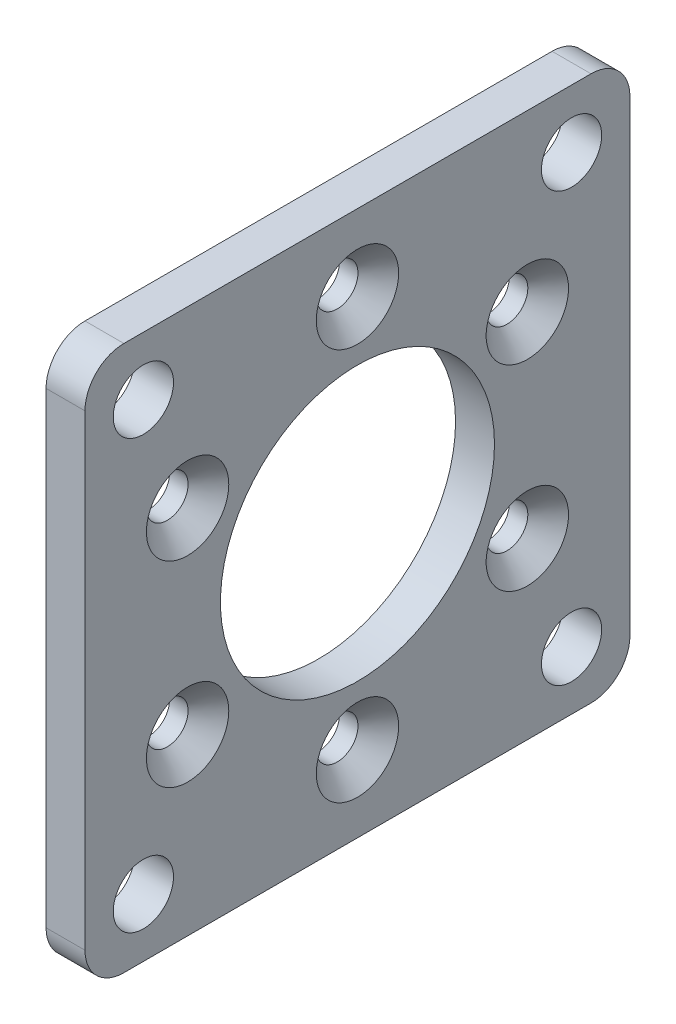
ISO-10303-21;
HEADER;
FILE_DESCRIPTION(('STEP AP214'),'2;1');
FILE_NAME('part.step','',(''),(''),'','','');
FILE_SCHEMA(('AUTOMOTIVE_DESIGN { 1 0 10303 214 1 1 1 1 }'));
ENDSEC;
DATA;
#1=APPLICATION_CONTEXT('core data for automotive mechanical design processes');
#2=APPLICATION_PROTOCOL_DEFINITION('international standard','automotive_design',2000,#1);
#3=PRODUCT_CONTEXT('',#1,'mechanical');
#4=PRODUCT('Part','Part','',(#3));
#5=PRODUCT_RELATED_PRODUCT_CATEGORY('part','',(#4));
#6=PRODUCT_DEFINITION_FORMATION('','',#4);
#7=PRODUCT_DEFINITION_CONTEXT('part definition',#1,'design');
#8=PRODUCT_DEFINITION('design','',#6,#7);
#9=PRODUCT_DEFINITION_SHAPE('','',#8);
#10=(LENGTH_UNIT() NAMED_UNIT(*) SI_UNIT(.MILLI.,.METRE.));
#11=(NAMED_UNIT(*) PLANE_ANGLE_UNIT() SI_UNIT($,.RADIAN.));
#12=(NAMED_UNIT(*) SI_UNIT($,.STERADIAN.) SOLID_ANGLE_UNIT());
#13=UNCERTAINTY_MEASURE_WITH_UNIT(LENGTH_MEASURE(1.E-05),#10,'distance_accuracy_value','');
#14=(GEOMETRIC_REPRESENTATION_CONTEXT(3) GLOBAL_UNCERTAINTY_ASSIGNED_CONTEXT((#13)) GLOBAL_UNIT_ASSIGNED_CONTEXT((#10,
#11,#12)) REPRESENTATION_CONTEXT('',''));
#15=CARTESIAN_POINT('',(0.,0.,0.));
#16=DIRECTION('',(0.,0.,1.));
#17=DIRECTION('',(1.,0.,0.));
#18=AXIS2_PLACEMENT_3D('',#15,#16,#17);
#19=CARTESIAN_POINT('',(3.175,0.,0.));
#20=DIRECTION('',(1.,0.,0.));
#21=DIRECTION('',(0.,0.,-1.));
#22=AXIS2_PLACEMENT_3D('',#19,#20,#21);
#23=PLANE('',#22);
#24=CARTESIAN_POINT('',(3.175,16.,0.));
#25=DIRECTION('',(1.,0.,0.));
#26=DIRECTION('',(0.,0.,-1.));
#27=AXIS2_PLACEMENT_3D('',#24,#25,#26);
#28=CIRCLE('',#27,3.36);
#29=CARTESIAN_POINT('',(3.175,16.,-3.36));
#30=VERTEX_POINT('',#29);
#31=EDGE_CURVE('E265',#30,#30,#28,.T.);
#32=ORIENTED_EDGE('',*,*,#31,.F.);
#33=EDGE_LOOP('',(#32));
#34=FACE_BOUND('',#33,.T.);
#35=CARTESIAN_POINT('',(3.175,8.00000000000145,-13.8564064605519));
#36=DIRECTION('',(1.,0.,0.));
#37=DIRECTION('',(0.,0.,-1.));
#38=AXIS2_PLACEMENT_3D('',#35,#36,#37);
#39=CIRCLE('',#38,3.36);
#40=CARTESIAN_POINT('',(3.175,8.00000000000145,-17.2164064605519));
#41=VERTEX_POINT('',#40);
#42=EDGE_CURVE('E256',#41,#41,#39,.T.);
#43=ORIENTED_EDGE('',*,*,#42,.F.);
#44=EDGE_LOOP('',(#43));
#45=FACE_BOUND('',#44,.T.);
#46=CARTESIAN_POINT('',(3.175,-7.99999999999855,-13.8564064605535));
#47=DIRECTION('',(1.,0.,0.));
#48=DIRECTION('',(0.,0.,-1.));
#49=AXIS2_PLACEMENT_3D('',#46,#47,#48);
#50=CIRCLE('',#49,3.36);
#51=CARTESIAN_POINT('',(3.175,-7.99999999999855,-17.2164064605535));
#52=VERTEX_POINT('',#51);
#53=EDGE_CURVE('E247',#52,#52,#50,.T.);
#54=ORIENTED_EDGE('',*,*,#53,.F.);
#55=EDGE_LOOP('',(#54));
#56=FACE_BOUND('',#55,.T.);
#57=CARTESIAN_POINT('',(3.175,-16.,-3.34338137020771E-12));
#58=DIRECTION('',(1.,0.,0.));
#59=DIRECTION('',(0.,0.,-1.));
#60=AXIS2_PLACEMENT_3D('',#57,#58,#59);
#61=CIRCLE('',#60,3.36);
#62=CARTESIAN_POINT('',(3.175,-16.,-3.36000000000334));
#63=VERTEX_POINT('',#62);
#64=EDGE_CURVE('E238',#63,#63,#61,.T.);
#65=ORIENTED_EDGE('',*,*,#64,.F.);
#66=EDGE_LOOP('',(#65));
#67=FACE_BOUND('',#66,.T.);
#68=CARTESIAN_POINT('',(3.175,-8.00000000000145,13.8564064605485));
#69=DIRECTION('',(1.,0.,0.));
#70=DIRECTION('',(0.,0.,-1.));
#71=AXIS2_PLACEMENT_3D('',#68,#69,#70);
#72=CIRCLE('',#71,3.36);
#73=CARTESIAN_POINT('',(3.175,-8.00000000000145,10.4964064605485));
#74=VERTEX_POINT('',#73);
#75=EDGE_CURVE('E229',#74,#74,#72,.T.);
#76=ORIENTED_EDGE('',*,*,#75,.F.);
#77=EDGE_LOOP('',(#76));
#78=FACE_BOUND('',#77,.T.);
#79=CARTESIAN_POINT('',(3.175,7.99999999999856,13.8564064605502));
#80=DIRECTION('',(1.,0.,0.));
#81=DIRECTION('',(0.,0.,-1.));
#82=AXIS2_PLACEMENT_3D('',#79,#80,#81);
#83=CIRCLE('',#82,3.36);
#84=CARTESIAN_POINT('',(3.175,7.99999999999856,10.4964064605502));
#85=VERTEX_POINT('',#84);
#86=EDGE_CURVE('E220',#85,#85,#83,.T.);
#87=ORIENTED_EDGE('',*,*,#86,.F.);
#88=EDGE_LOOP('',(#87));
#89=FACE_BOUND('',#88,.T.);
#90=CARTESIAN_POINT('',(3.175,17.4625,17.4625));
#91=DIRECTION('',(1.,0.,0.));
#92=DIRECTION('',(0.,0.,-1.));
#93=AXIS2_PLACEMENT_3D('',#90,#91,#92);
#94=CIRCLE('',#93,2.45745);
#95=CARTESIAN_POINT('',(3.175,17.4625,15.00505));
#96=VERTEX_POINT('',#95);
#97=EDGE_CURVE('E211',#96,#96,#94,.T.);
#98=ORIENTED_EDGE('',*,*,#97,.F.);
#99=EDGE_LOOP('',(#98));
#100=FACE_BOUND('',#99,.T.);
#101=CARTESIAN_POINT('',(3.175,17.4625,-17.4625));
#102=DIRECTION('',(1.,0.,0.));
#103=DIRECTION('',(0.,0.,-1.));
#104=AXIS2_PLACEMENT_3D('',#101,#102,#103);
#105=CIRCLE('',#104,2.45745);
#106=CARTESIAN_POINT('',(3.175,17.4625,-19.91995));
#107=VERTEX_POINT('',#106);
#108=EDGE_CURVE('E205',#107,#107,#105,.T.);
#109=ORIENTED_EDGE('',*,*,#108,.F.);
#110=EDGE_LOOP('',(#109));
#111=FACE_BOUND('',#110,.T.);
#112=CARTESIAN_POINT('',(3.175,-17.4625,-17.4625));
#113=DIRECTION('',(1.,0.,0.));
#114=DIRECTION('',(0.,0.,-1.));
#115=AXIS2_PLACEMENT_3D('',#112,#113,#114);
#116=CIRCLE('',#115,2.45745);
#117=CARTESIAN_POINT('',(3.175,-17.4625,-19.91995));
#118=VERTEX_POINT('',#117);
#119=EDGE_CURVE('E199',#118,#118,#116,.T.);
#120=ORIENTED_EDGE('',*,*,#119,.F.);
#121=EDGE_LOOP('',(#120));
#122=FACE_BOUND('',#121,.T.);
#123=CARTESIAN_POINT('',(3.175,-17.4625,17.4625));
#124=DIRECTION('',(1.,0.,0.));
#125=DIRECTION('',(0.,0.,-1.));
#126=AXIS2_PLACEMENT_3D('',#123,#124,#125);
#127=CIRCLE('',#126,2.45745);
#128=CARTESIAN_POINT('',(3.175,-17.4625,15.00505));
#129=VERTEX_POINT('',#128);
#130=EDGE_CURVE('E193',#129,#129,#127,.T.);
#131=ORIENTED_EDGE('',*,*,#130,.F.);
#132=EDGE_LOOP('',(#131));
#133=FACE_BOUND('',#132,.T.);
#134=DIRECTION('',(0.,0.,1.));
#135=VECTOR('',#134,1.);
#136=CARTESIAN_POINT('',(3.175,22.225,-22.225));
#137=LINE('',#136,#135);
#138=CARTESIAN_POINT('',(3.175,22.225,-19.05));
#139=VERTEX_POINT('',#138);
#140=CARTESIAN_POINT('',(3.175,22.225,19.05));
#141=VERTEX_POINT('',#140);
#142=EDGE_CURVE('E144',#139,#141,#137,.T.);
#143=ORIENTED_EDGE('',*,*,#142,.T.);
#144=CARTESIAN_POINT('',(3.175,19.05,19.05));
#145=DIRECTION('',(1.,0.,0.));
#146=DIRECTION('',(0.,0.,-1.));
#147=AXIS2_PLACEMENT_3D('',#144,#145,#146);
#148=CIRCLE('',#147,3.175);
#149=CARTESIAN_POINT('',(3.175,19.05,22.225));
#150=VERTEX_POINT('',#149);
#151=EDGE_CURVE('E163',#141,#150,#148,.T.);
#152=ORIENTED_EDGE('',*,*,#151,.T.);
#153=DIRECTION('',(0.,-1.,0.));
#154=VECTOR('',#153,1.);
#155=CARTESIAN_POINT('',(3.175,-22.225,22.225));
#156=LINE('',#155,#154);
#157=CARTESIAN_POINT('',(3.175,-19.05,22.225));
#158=VERTEX_POINT('',#157);
#159=EDGE_CURVE('E127',#150,#158,#156,.T.);
#160=ORIENTED_EDGE('',*,*,#159,.T.);
#161=CARTESIAN_POINT('',(3.175,-19.05,19.05));
#162=DIRECTION('',(1.,0.,0.));
#163=DIRECTION('',(0.,0.,-1.));
#164=AXIS2_PLACEMENT_3D('',#161,#162,#163);
#165=CIRCLE('',#164,3.175);
#166=CARTESIAN_POINT('',(3.175,-22.225,19.05));
#167=VERTEX_POINT('',#166);
#168=EDGE_CURVE('E158',#158,#167,#165,.T.);
#169=ORIENTED_EDGE('',*,*,#168,.T.);
#170=DIRECTION('',(0.,0.,-1.));
#171=VECTOR('',#170,1.);
#172=CARTESIAN_POINT('',(3.175,-22.225,-22.225));
#173=LINE('',#172,#171);
#174=CARTESIAN_POINT('',(3.175,-22.225,-19.05));
#175=VERTEX_POINT('',#174);
#176=EDGE_CURVE('E174',#167,#175,#173,.T.);
#177=ORIENTED_EDGE('',*,*,#176,.T.);
#178=CARTESIAN_POINT('',(3.175,-19.05,-19.05));
#179=DIRECTION('',(1.,0.,0.));
#180=DIRECTION('',(0.,0.,-1.));
#181=AXIS2_PLACEMENT_3D('',#178,#179,#180);
#182=CIRCLE('',#181,3.175);
#183=CARTESIAN_POINT('',(3.175,-19.05,-22.225));
#184=VERTEX_POINT('',#183);
#185=EDGE_CURVE('E63',#175,#184,#182,.T.);
#186=ORIENTED_EDGE('',*,*,#185,.T.);
#187=DIRECTION('',(0.,1.,0.));
#188=VECTOR('',#187,1.);
#189=CARTESIAN_POINT('',(3.175,-22.225,-22.225));
#190=LINE('',#189,#188);
#191=CARTESIAN_POINT('',(3.175,19.05,-22.225));
#192=VERTEX_POINT('',#191);
#193=EDGE_CURVE('E182',#184,#192,#190,.T.);
#194=ORIENTED_EDGE('',*,*,#193,.T.);
#195=CARTESIAN_POINT('',(3.175,19.05,-19.05));
#196=DIRECTION('',(1.,0.,0.));
#197=DIRECTION('',(0.,0.,-1.));
#198=AXIS2_PLACEMENT_3D('',#195,#196,#197);
#199=CIRCLE('',#198,3.175);
#200=EDGE_CURVE('E161',#192,#139,#199,.T.);
#201=ORIENTED_EDGE('',*,*,#200,.T.);
#202=EDGE_LOOP('',(#143,#152,#160,#169,#177,#186,#194,#201));
#203=FACE_BOUND('',#202,.T.);
#204=CARTESIAN_POINT('',(3.175,0.,0.));
#205=DIRECTION('',(1.,0.,0.));
#206=DIRECTION('',(0.,0.,-1.));
#207=AXIS2_PLACEMENT_3D('',#204,#205,#206);
#208=CIRCLE('',#207,11.176);
#209=CARTESIAN_POINT('',(3.175,0.,-11.176));
#210=VERTEX_POINT('',#209);
#211=EDGE_CURVE('E135',#210,#210,#208,.T.);
#212=ORIENTED_EDGE('',*,*,#211,.F.);
#213=EDGE_LOOP('',(#212));
#214=FACE_BOUND('',#213,.T.);
#215=ADVANCED_FACE('F41',(#34,#45,#56,#67,#78,#89,#100,#111,#122,#133,#203,#214),#23,.T.);
#216=CARTESIAN_POINT('',(0.,0.,0.));
#217=DIRECTION('',(1.,0.,0.));
#218=DIRECTION('',(0.,0.,-1.));
#219=AXIS2_PLACEMENT_3D('',#216,#217,#218);
#220=PLANE('',#219);
#221=CARTESIAN_POINT('',(0.,16.,0.));
#222=DIRECTION('',(1.,0.,0.));
#223=DIRECTION('',(0.,0.,-1.));
#224=AXIS2_PLACEMENT_3D('',#221,#222,#223);
#225=CIRCLE('',#224,1.7);
#226=CARTESIAN_POINT('',(0.,16.,-1.7));
#227=VERTEX_POINT('',#226);
#228=EDGE_CURVE('E259',#227,#227,#225,.T.);
#229=ORIENTED_EDGE('',*,*,#228,.T.);
#230=EDGE_LOOP('',(#229));
#231=FACE_BOUND('',#230,.T.);
#232=CARTESIAN_POINT('',(0.,8.00000000000145,-13.8564064605519));
#233=DIRECTION('',(1.,0.,0.));
#234=DIRECTION('',(0.,0.,-1.));
#235=AXIS2_PLACEMENT_3D('',#232,#233,#234);
#236=CIRCLE('',#235,1.7);
#237=CARTESIAN_POINT('',(0.,8.00000000000145,-15.5564064605519));
#238=VERTEX_POINT('',#237);
#239=EDGE_CURVE('E250',#238,#238,#236,.T.);
#240=ORIENTED_EDGE('',*,*,#239,.T.);
#241=EDGE_LOOP('',(#240));
#242=FACE_BOUND('',#241,.T.);
#243=CARTESIAN_POINT('',(0.,-7.99999999999855,-13.8564064605535));
#244=DIRECTION('',(1.,0.,0.));
#245=DIRECTION('',(0.,0.,-1.));
#246=AXIS2_PLACEMENT_3D('',#243,#244,#245);
#247=CIRCLE('',#246,1.7);
#248=CARTESIAN_POINT('',(0.,-7.99999999999855,-15.5564064605535));
#249=VERTEX_POINT('',#248);
#250=EDGE_CURVE('E241',#249,#249,#247,.T.);
#251=ORIENTED_EDGE('',*,*,#250,.T.);
#252=EDGE_LOOP('',(#251));
#253=FACE_BOUND('',#252,.T.);
#254=CARTESIAN_POINT('',(0.,-16.,-3.34338137020771E-12));
#255=DIRECTION('',(1.,0.,0.));
#256=DIRECTION('',(0.,0.,-1.));
#257=AXIS2_PLACEMENT_3D('',#254,#255,#256);
#258=CIRCLE('',#257,1.7);
#259=CARTESIAN_POINT('',(0.,-16.,-1.70000000000334));
#260=VERTEX_POINT('',#259);
#261=EDGE_CURVE('E232',#260,#260,#258,.T.);
#262=ORIENTED_EDGE('',*,*,#261,.T.);
#263=EDGE_LOOP('',(#262));
#264=FACE_BOUND('',#263,.T.);
#265=CARTESIAN_POINT('',(0.,-8.00000000000145,13.8564064605485));
#266=DIRECTION('',(1.,0.,0.));
#267=DIRECTION('',(0.,0.,-1.));
#268=AXIS2_PLACEMENT_3D('',#265,#266,#267);
#269=CIRCLE('',#268,1.7);
#270=CARTESIAN_POINT('',(0.,-8.00000000000145,12.1564064605485));
#271=VERTEX_POINT('',#270);
#272=EDGE_CURVE('E223',#271,#271,#269,.T.);
#273=ORIENTED_EDGE('',*,*,#272,.T.);
#274=EDGE_LOOP('',(#273));
#275=FACE_BOUND('',#274,.T.);
#276=CARTESIAN_POINT('',(0.,7.99999999999856,13.8564064605502));
#277=DIRECTION('',(1.,0.,0.));
#278=DIRECTION('',(0.,0.,-1.));
#279=AXIS2_PLACEMENT_3D('',#276,#277,#278);
#280=CIRCLE('',#279,1.7);
#281=CARTESIAN_POINT('',(0.,7.99999999999856,12.1564064605502));
#282=VERTEX_POINT('',#281);
#283=EDGE_CURVE('E214',#282,#282,#280,.T.);
#284=ORIENTED_EDGE('',*,*,#283,.T.);
#285=EDGE_LOOP('',(#284));
#286=FACE_BOUND('',#285,.T.);
#287=CARTESIAN_POINT('',(0.,17.4625,17.4625));
#288=DIRECTION('',(1.,0.,0.));
#289=DIRECTION('',(0.,0.,-1.));
#290=AXIS2_PLACEMENT_3D('',#287,#288,#289);
#291=CIRCLE('',#290,2.45745);
#292=CARTESIAN_POINT('',(0.,17.4625,15.00505));
#293=VERTEX_POINT('',#292);
#294=EDGE_CURVE('E208',#293,#293,#291,.T.);
#295=ORIENTED_EDGE('',*,*,#294,.T.);
#296=EDGE_LOOP('',(#295));
#297=FACE_BOUND('',#296,.T.);
#298=CARTESIAN_POINT('',(0.,17.4625,-17.4625));
#299=DIRECTION('',(1.,0.,0.));
#300=DIRECTION('',(0.,0.,-1.));
#301=AXIS2_PLACEMENT_3D('',#298,#299,#300);
#302=CIRCLE('',#301,2.45745);
#303=CARTESIAN_POINT('',(0.,17.4625,-19.91995));
#304=VERTEX_POINT('',#303);
#305=EDGE_CURVE('E202',#304,#304,#302,.T.);
#306=ORIENTED_EDGE('',*,*,#305,.T.);
#307=EDGE_LOOP('',(#306));
#308=FACE_BOUND('',#307,.T.);
#309=CARTESIAN_POINT('',(0.,-17.4625,-17.4625));
#310=DIRECTION('',(1.,0.,0.));
#311=DIRECTION('',(0.,0.,-1.));
#312=AXIS2_PLACEMENT_3D('',#309,#310,#311);
#313=CIRCLE('',#312,2.45745);
#314=CARTESIAN_POINT('',(0.,-17.4625,-19.91995));
#315=VERTEX_POINT('',#314);
#316=EDGE_CURVE('E196',#315,#315,#313,.T.);
#317=ORIENTED_EDGE('',*,*,#316,.T.);
#318=EDGE_LOOP('',(#317));
#319=FACE_BOUND('',#318,.T.);
#320=CARTESIAN_POINT('',(0.,-17.4625,17.4625));
#321=DIRECTION('',(1.,0.,0.));
#322=DIRECTION('',(0.,0.,-1.));
#323=AXIS2_PLACEMENT_3D('',#320,#321,#322);
#324=CIRCLE('',#323,2.45745);
#325=CARTESIAN_POINT('',(0.,-17.4625,15.00505));
#326=VERTEX_POINT('',#325);
#327=EDGE_CURVE('E189',#326,#326,#324,.T.);
#328=ORIENTED_EDGE('',*,*,#327,.T.);
#329=EDGE_LOOP('',(#328));
#330=FACE_BOUND('',#329,.T.);
#331=DIRECTION('',(0.,-1.,0.));
#332=VECTOR('',#331,1.);
#333=CARTESIAN_POINT('',(0.,-22.225,22.225));
#334=LINE('',#333,#332);
#335=CARTESIAN_POINT('',(0.,19.05,22.225));
#336=VERTEX_POINT('',#335);
#337=CARTESIAN_POINT('',(0.,-19.05,22.225));
#338=VERTEX_POINT('',#337);
#339=EDGE_CURVE('E124',#336,#338,#334,.T.);
#340=ORIENTED_EDGE('',*,*,#339,.F.);
#341=CARTESIAN_POINT('',(0.,19.05,19.05));
#342=DIRECTION('',(1.,0.,0.));
#343=DIRECTION('',(0.,0.,-1.));
#344=AXIS2_PLACEMENT_3D('',#341,#342,#343);
#345=CIRCLE('',#344,3.175);
#346=CARTESIAN_POINT('',(0.,22.225,19.05));
#347=VERTEX_POINT('',#346);
#348=EDGE_CURVE('E107',#336,#347,#345,.F.);
#349=ORIENTED_EDGE('',*,*,#348,.T.);
#350=DIRECTION('',(0.,0.,1.));
#351=VECTOR('',#350,1.);
#352=CARTESIAN_POINT('',(0.,22.225,-22.225));
#353=LINE('',#352,#351);
#354=CARTESIAN_POINT('',(0.,22.225,-19.05));
#355=VERTEX_POINT('',#354);
#356=EDGE_CURVE('E148',#355,#347,#353,.T.);
#357=ORIENTED_EDGE('',*,*,#356,.F.);
#358=CARTESIAN_POINT('',(0.,19.05,-19.05));
#359=DIRECTION('',(1.,0.,0.));
#360=DIRECTION('',(0.,0.,-1.));
#361=AXIS2_PLACEMENT_3D('',#358,#359,#360);
#362=CIRCLE('',#361,3.175);
#363=CARTESIAN_POINT('',(0.,19.05,-22.225));
#364=VERTEX_POINT('',#363);
#365=EDGE_CURVE('E118',#355,#364,#362,.F.);
#366=ORIENTED_EDGE('',*,*,#365,.T.);
#367=DIRECTION('',(0.,1.,0.));
#368=VECTOR('',#367,1.);
#369=CARTESIAN_POINT('',(0.,-22.225,-22.225));
#370=LINE('',#369,#368);
#371=CARTESIAN_POINT('',(0.,-19.05,-22.225));
#372=VERTEX_POINT('',#371);
#373=EDGE_CURVE('E138',#372,#364,#370,.T.);
#374=ORIENTED_EDGE('',*,*,#373,.F.);
#375=CARTESIAN_POINT('',(0.,-19.05,-19.05));
#376=DIRECTION('',(1.,0.,0.));
#377=DIRECTION('',(0.,0.,-1.));
#378=AXIS2_PLACEMENT_3D('',#375,#376,#377);
#379=CIRCLE('',#378,3.175);
#380=CARTESIAN_POINT('',(0.,-22.225,-19.05));
#381=VERTEX_POINT('',#380);
#382=EDGE_CURVE('E152',#372,#381,#379,.F.);
#383=ORIENTED_EDGE('',*,*,#382,.T.);
#384=DIRECTION('',(0.,0.,-1.));
#385=VECTOR('',#384,1.);
#386=CARTESIAN_POINT('',(0.,-22.225,-22.225));
#387=LINE('',#386,#385);
#388=CARTESIAN_POINT('',(0.,-22.225,19.05));
#389=VERTEX_POINT('',#388);
#390=EDGE_CURVE('E134',#389,#381,#387,.T.);
#391=ORIENTED_EDGE('',*,*,#390,.F.);
#392=CARTESIAN_POINT('',(0.,-19.05,19.05));
#393=DIRECTION('',(1.,0.,0.));
#394=DIRECTION('',(0.,0.,-1.));
#395=AXIS2_PLACEMENT_3D('',#392,#393,#394);
#396=CIRCLE('',#395,3.175);
#397=EDGE_CURVE('E128',#389,#338,#396,.F.);
#398=ORIENTED_EDGE('',*,*,#397,.T.);
#399=EDGE_LOOP('',(#340,#349,#357,#366,#374,#383,#391,#398));
#400=FACE_BOUND('',#399,.T.);
#401=CARTESIAN_POINT('',(0.,0.,0.));
#402=DIRECTION('',(1.,0.,0.));
#403=DIRECTION('',(0.,0.,-1.));
#404=AXIS2_PLACEMENT_3D('',#401,#402,#403);
#405=CIRCLE('',#404,11.176);
#406=CARTESIAN_POINT('',(0.,0.,-11.176));
#407=VERTEX_POINT('',#406);
#408=EDGE_CURVE('E141',#407,#407,#405,.T.);
#409=ORIENTED_EDGE('',*,*,#408,.T.);
#410=EDGE_LOOP('',(#409));
#411=FACE_BOUND('',#410,.T.);
#412=ADVANCED_FACE('F131',(#231,#242,#253,#264,#275,#286,#297,#308,#319,#330,#400,#411),#220,.F.);
#413=CARTESIAN_POINT('',(3.175,-22.225,22.225));
#414=DIRECTION('',(0.,0.,-1.));
#415=DIRECTION('',(-1.,0.,0.));
#416=AXIS2_PLACEMENT_3D('',#413,#414,#415);
#417=PLANE('',#416);
#418=ORIENTED_EDGE('',*,*,#159,.F.);
#419=DIRECTION('',(-1.,0.,0.));
#420=VECTOR('',#419,1.);
#421=CARTESIAN_POINT('',(3.175,19.05,22.225));
#422=LINE('',#421,#420);
#423=EDGE_CURVE('E111',#150,#336,#422,.T.);
#424=ORIENTED_EDGE('',*,*,#423,.T.);
#425=ORIENTED_EDGE('',*,*,#339,.T.);
#426=DIRECTION('',(-1.,0.,0.));
#427=VECTOR('',#426,1.);
#428=CARTESIAN_POINT('',(3.175,-19.05,22.225));
#429=LINE('',#428,#427);
#430=EDGE_CURVE('E129',#338,#158,#429,.F.);
#431=ORIENTED_EDGE('',*,*,#430,.T.);
#432=EDGE_LOOP('',(#418,#424,#425,#431));
#433=FACE_BOUND('',#432,.T.);
#434=ADVANCED_FACE('F123',(#433),#417,.F.);
#435=CARTESIAN_POINT('',(3.175,-22.225,-22.225));
#436=DIRECTION('',(0.,1.,0.));
#437=DIRECTION('',(0.,0.,1.));
#438=AXIS2_PLACEMENT_3D('',#435,#436,#437);
#439=PLANE('',#438);
#440=ORIENTED_EDGE('',*,*,#390,.T.);
#441=DIRECTION('',(-1.,0.,0.));
#442=VECTOR('',#441,1.);
#443=CARTESIAN_POINT('',(3.175,-22.225,-19.05));
#444=LINE('',#443,#442);
#445=EDGE_CURVE('E11',#381,#175,#444,.F.);
#446=ORIENTED_EDGE('',*,*,#445,.T.);
#447=ORIENTED_EDGE('',*,*,#176,.F.);
#448=DIRECTION('',(-1.,0.,0.));
#449=VECTOR('',#448,1.);
#450=CARTESIAN_POINT('',(3.175,-22.225,19.05));
#451=LINE('',#450,#449);
#452=EDGE_CURVE('E49',#167,#389,#451,.T.);
#453=ORIENTED_EDGE('',*,*,#452,.T.);
#454=EDGE_LOOP('',(#440,#446,#447,#453));
#455=FACE_BOUND('',#454,.T.);
#456=ADVANCED_FACE('F172',(#455),#439,.F.);
#457=CARTESIAN_POINT('',(3.175,-22.225,-22.225));
#458=DIRECTION('',(0.,0.,1.));
#459=DIRECTION('',(1.,0.,0.));
#460=AXIS2_PLACEMENT_3D('',#457,#458,#459);
#461=PLANE('',#460);
#462=ORIENTED_EDGE('',*,*,#373,.T.);
#463=DIRECTION('',(-1.,0.,0.));
#464=VECTOR('',#463,1.);
#465=CARTESIAN_POINT('',(3.175,19.05,-22.225));
#466=LINE('',#465,#464);
#467=EDGE_CURVE('E56',#364,#192,#466,.F.);
#468=ORIENTED_EDGE('',*,*,#467,.T.);
#469=ORIENTED_EDGE('',*,*,#193,.F.);
#470=DIRECTION('',(-1.,0.,0.));
#471=VECTOR('',#470,1.);
#472=CARTESIAN_POINT('',(3.175,-19.05,-22.225));
#473=LINE('',#472,#471);
#474=EDGE_CURVE('E165',#184,#372,#473,.T.);
#475=ORIENTED_EDGE('',*,*,#474,.T.);
#476=EDGE_LOOP('',(#462,#468,#469,#475));
#477=FACE_BOUND('',#476,.T.);
#478=ADVANCED_FACE('F181',(#477),#461,.F.);
#479=CARTESIAN_POINT('',(3.175,22.225,-22.225));
#480=DIRECTION('',(0.,-1.,0.));
#481=DIRECTION('',(0.,0.,-1.));
#482=AXIS2_PLACEMENT_3D('',#479,#480,#481);
#483=PLANE('',#482);
#484=ORIENTED_EDGE('',*,*,#356,.T.);
#485=DIRECTION('',(-1.,0.,0.));
#486=VECTOR('',#485,1.);
#487=CARTESIAN_POINT('',(3.175,22.225,19.05));
#488=LINE('',#487,#486);
#489=EDGE_CURVE('E112',#347,#141,#488,.F.);
#490=ORIENTED_EDGE('',*,*,#489,.T.);
#491=ORIENTED_EDGE('',*,*,#142,.F.);
#492=DIRECTION('',(-1.,0.,0.));
#493=VECTOR('',#492,1.);
#494=CARTESIAN_POINT('',(3.175,22.225,-19.05));
#495=LINE('',#494,#493);
#496=EDGE_CURVE('E117',#139,#355,#495,.T.);
#497=ORIENTED_EDGE('',*,*,#496,.T.);
#498=EDGE_LOOP('',(#484,#490,#491,#497));
#499=FACE_BOUND('',#498,.T.);
#500=ADVANCED_FACE('F299',(#499),#483,.F.);
#501=CARTESIAN_POINT('',(3.175,0.,0.));
#502=DIRECTION('',(-1.,0.,0.));
#503=DIRECTION('',(0.,0.,1.));
#504=AXIS2_PLACEMENT_3D('',#501,#502,#503);
#505=CYLINDRICAL_SURFACE('',#504,11.176);
#506=ORIENTED_EDGE('',*,*,#211,.T.);
#507=EDGE_LOOP('',(#506));
#508=FACE_BOUND('',#507,.T.);
#509=ORIENTED_EDGE('',*,*,#408,.F.);
#510=EDGE_LOOP('',(#509));
#511=FACE_BOUND('',#510,.T.);
#512=ADVANCED_FACE('F295',(#508,#511),#505,.F.);
#513=CARTESIAN_POINT('',(3.175,-17.4625,17.4625));
#514=DIRECTION('',(1.,0.,0.));
#515=DIRECTION('',(0.,0.,-1.));
#516=AXIS2_PLACEMENT_3D('',#513,#514,#515);
#517=CYLINDRICAL_SURFACE('',#516,2.45745);
#518=ORIENTED_EDGE('',*,*,#327,.F.);
#519=EDGE_LOOP('',(#518));
#520=FACE_BOUND('',#519,.T.);
#521=ORIENTED_EDGE('',*,*,#130,.T.);
#522=EDGE_LOOP('',(#521));
#523=FACE_BOUND('',#522,.T.);
#524=ADVANCED_FACE('F298',(#520,#523),#517,.F.);
#525=CARTESIAN_POINT('',(3.175,-17.4625,-17.4625));
#526=DIRECTION('',(1.,0.,0.));
#527=DIRECTION('',(0.,0.,-1.));
#528=AXIS2_PLACEMENT_3D('',#525,#526,#527);
#529=CYLINDRICAL_SURFACE('',#528,2.45745);
#530=ORIENTED_EDGE('',*,*,#316,.F.);
#531=EDGE_LOOP('',(#530));
#532=FACE_BOUND('',#531,.T.);
#533=ORIENTED_EDGE('',*,*,#119,.T.);
#534=EDGE_LOOP('',(#533));
#535=FACE_BOUND('',#534,.T.);
#536=ADVANCED_FACE('F485',(#532,#535),#529,.F.);
#537=CARTESIAN_POINT('',(3.175,17.4625,-17.4625));
#538=DIRECTION('',(1.,0.,0.));
#539=DIRECTION('',(0.,0.,-1.));
#540=AXIS2_PLACEMENT_3D('',#537,#538,#539);
#541=CYLINDRICAL_SURFACE('',#540,2.45745);
#542=ORIENTED_EDGE('',*,*,#305,.F.);
#543=EDGE_LOOP('',(#542));
#544=FACE_BOUND('',#543,.T.);
#545=ORIENTED_EDGE('',*,*,#108,.T.);
#546=EDGE_LOOP('',(#545));
#547=FACE_BOUND('',#546,.T.);
#548=ADVANCED_FACE('F475',(#544,#547),#541,.F.);
#549=CARTESIAN_POINT('',(3.175,17.4625,17.4625));
#550=DIRECTION('',(1.,0.,0.));
#551=DIRECTION('',(0.,0.,-1.));
#552=AXIS2_PLACEMENT_3D('',#549,#550,#551);
#553=CYLINDRICAL_SURFACE('',#552,2.45745);
#554=ORIENTED_EDGE('',*,*,#294,.F.);
#555=EDGE_LOOP('',(#554));
#556=FACE_BOUND('',#555,.T.);
#557=ORIENTED_EDGE('',*,*,#97,.T.);
#558=EDGE_LOOP('',(#557));
#559=FACE_BOUND('',#558,.T.);
#560=ADVANCED_FACE('F465',(#556,#559),#553,.F.);
#561=CARTESIAN_POINT('',(3.175,7.99999999999856,13.8564064605502));
#562=DIRECTION('',(1.,0.,0.));
#563=DIRECTION('',(0.,0.,-1.));
#564=AXIS2_PLACEMENT_3D('',#561,#562,#563);
#565=CYLINDRICAL_SURFACE('',#564,1.7);
#566=ORIENTED_EDGE('',*,*,#283,.F.);
#567=EDGE_LOOP('',(#566));
#568=FACE_BOUND('',#567,.T.);
#569=CARTESIAN_POINT('',(1.515,7.99999999999856,13.8564064605502));
#570=DIRECTION('',(1.,0.,0.));
#571=DIRECTION('',(0.,0.,-1.));
#572=AXIS2_PLACEMENT_3D('',#569,#570,#571);
#573=CIRCLE('',#572,1.7);
#574=CARTESIAN_POINT('',(1.515,7.99999999999856,12.1564064605502));
#575=VERTEX_POINT('',#574);
#576=EDGE_CURVE('E217',#575,#575,#573,.T.);
#577=ORIENTED_EDGE('',*,*,#576,.T.);
#578=EDGE_LOOP('',(#577));
#579=FACE_BOUND('',#578,.T.);
#580=ADVANCED_FACE('F455',(#568,#579),#565,.F.);
#581=CARTESIAN_POINT('',(3.175,7.99999999999856,13.8564064605502));
#582=DIRECTION('',(1.,0.,0.));
#583=DIRECTION('',(0.,0.,-1.));
#584=AXIS2_PLACEMENT_3D('',#581,#582,#583);
#585=CONICAL_SURFACE('',#584,3.36,0.785398163397448);
#586=ORIENTED_EDGE('',*,*,#576,.F.);
#587=EDGE_LOOP('',(#586));
#588=FACE_BOUND('',#587,.T.);
#589=ORIENTED_EDGE('',*,*,#86,.T.);
#590=EDGE_LOOP('',(#589));
#591=FACE_BOUND('',#590,.T.);
#592=ADVANCED_FACE('F445',(#588,#591),#585,.F.);
#593=CARTESIAN_POINT('',(3.175,-8.00000000000145,13.8564064605485));
#594=DIRECTION('',(1.,0.,0.));
#595=DIRECTION('',(0.,0.,-1.));
#596=AXIS2_PLACEMENT_3D('',#593,#594,#595);
#597=CYLINDRICAL_SURFACE('',#596,1.7);
#598=ORIENTED_EDGE('',*,*,#272,.F.);
#599=EDGE_LOOP('',(#598));
#600=FACE_BOUND('',#599,.T.);
#601=CARTESIAN_POINT('',(1.515,-8.00000000000145,13.8564064605485));
#602=DIRECTION('',(1.,0.,0.));
#603=DIRECTION('',(0.,0.,-1.));
#604=AXIS2_PLACEMENT_3D('',#601,#602,#603);
#605=CIRCLE('',#604,1.7);
#606=CARTESIAN_POINT('',(1.515,-8.00000000000145,12.1564064605485));
#607=VERTEX_POINT('',#606);
#608=EDGE_CURVE('E226',#607,#607,#605,.T.);
#609=ORIENTED_EDGE('',*,*,#608,.T.);
#610=EDGE_LOOP('',(#609));
#611=FACE_BOUND('',#610,.T.);
#612=ADVANCED_FACE('F435',(#600,#611),#597,.F.);
#613=CARTESIAN_POINT('',(3.175,-8.00000000000145,13.8564064605485));
#614=DIRECTION('',(1.,0.,0.));
#615=DIRECTION('',(0.,0.,-1.));
#616=AXIS2_PLACEMENT_3D('',#613,#614,#615);
#617=CONICAL_SURFACE('',#616,3.36,0.785398163397449);
#618=ORIENTED_EDGE('',*,*,#608,.F.);
#619=EDGE_LOOP('',(#618));
#620=FACE_BOUND('',#619,.T.);
#621=ORIENTED_EDGE('',*,*,#75,.T.);
#622=EDGE_LOOP('',(#621));
#623=FACE_BOUND('',#622,.T.);
#624=ADVANCED_FACE('F425',(#620,#623),#617,.F.);
#625=CARTESIAN_POINT('',(3.175,-16.,-3.34338137020771E-12));
#626=DIRECTION('',(1.,0.,0.));
#627=DIRECTION('',(0.,0.,-1.));
#628=AXIS2_PLACEMENT_3D('',#625,#626,#627);
#629=CYLINDRICAL_SURFACE('',#628,1.7);
#630=ORIENTED_EDGE('',*,*,#261,.F.);
#631=EDGE_LOOP('',(#630));
#632=FACE_BOUND('',#631,.T.);
#633=CARTESIAN_POINT('',(1.515,-16.,-3.34338137020771E-12));
#634=DIRECTION('',(1.,0.,0.));
#635=DIRECTION('',(0.,0.,-1.));
#636=AXIS2_PLACEMENT_3D('',#633,#634,#635);
#637=CIRCLE('',#636,1.7);
#638=CARTESIAN_POINT('',(1.515,-16.,-1.70000000000334));
#639=VERTEX_POINT('',#638);
#640=EDGE_CURVE('E235',#639,#639,#637,.T.);
#641=ORIENTED_EDGE('',*,*,#640,.T.);
#642=EDGE_LOOP('',(#641));
#643=FACE_BOUND('',#642,.T.);
#644=ADVANCED_FACE('F415',(#632,#643),#629,.F.);
#645=CARTESIAN_POINT('',(3.175,-16.,-3.34338137020771E-12));
#646=DIRECTION('',(1.,0.,0.));
#647=DIRECTION('',(0.,0.,-1.));
#648=AXIS2_PLACEMENT_3D('',#645,#646,#647);
#649=CONICAL_SURFACE('',#648,3.36,0.785398163397448);
#650=ORIENTED_EDGE('',*,*,#640,.F.);
#651=EDGE_LOOP('',(#650));
#652=FACE_BOUND('',#651,.T.);
#653=ORIENTED_EDGE('',*,*,#64,.T.);
#654=EDGE_LOOP('',(#653));
#655=FACE_BOUND('',#654,.T.);
#656=ADVANCED_FACE('F405',(#652,#655),#649,.F.);
#657=CARTESIAN_POINT('',(3.175,-7.99999999999855,-13.8564064605535));
#658=DIRECTION('',(1.,0.,0.));
#659=DIRECTION('',(0.,0.,-1.));
#660=AXIS2_PLACEMENT_3D('',#657,#658,#659);
#661=CYLINDRICAL_SURFACE('',#660,1.7);
#662=ORIENTED_EDGE('',*,*,#250,.F.);
#663=EDGE_LOOP('',(#662));
#664=FACE_BOUND('',#663,.T.);
#665=CARTESIAN_POINT('',(1.515,-7.99999999999855,-13.8564064605535));
#666=DIRECTION('',(1.,0.,0.));
#667=DIRECTION('',(0.,0.,-1.));
#668=AXIS2_PLACEMENT_3D('',#665,#666,#667);
#669=CIRCLE('',#668,1.7);
#670=CARTESIAN_POINT('',(1.515,-7.99999999999855,-15.5564064605535));
#671=VERTEX_POINT('',#670);
#672=EDGE_CURVE('E244',#671,#671,#669,.T.);
#673=ORIENTED_EDGE('',*,*,#672,.T.);
#674=EDGE_LOOP('',(#673));
#675=FACE_BOUND('',#674,.T.);
#676=ADVANCED_FACE('F395',(#664,#675),#661,.F.);
#677=CARTESIAN_POINT('',(3.175,-7.99999999999855,-13.8564064605535));
#678=DIRECTION('',(1.,0.,0.));
#679=DIRECTION('',(0.,0.,-1.));
#680=AXIS2_PLACEMENT_3D('',#677,#678,#679);
#681=CONICAL_SURFACE('',#680,3.36,0.785398163397449);
#682=ORIENTED_EDGE('',*,*,#672,.F.);
#683=EDGE_LOOP('',(#682));
#684=FACE_BOUND('',#683,.T.);
#685=ORIENTED_EDGE('',*,*,#53,.T.);
#686=EDGE_LOOP('',(#685));
#687=FACE_BOUND('',#686,.T.);
#688=ADVANCED_FACE('F385',(#684,#687),#681,.F.);
#689=CARTESIAN_POINT('',(3.175,8.00000000000145,-13.8564064605519));
#690=DIRECTION('',(1.,0.,0.));
#691=DIRECTION('',(0.,0.,-1.));
#692=AXIS2_PLACEMENT_3D('',#689,#690,#691);
#693=CYLINDRICAL_SURFACE('',#692,1.7);
#694=ORIENTED_EDGE('',*,*,#239,.F.);
#695=EDGE_LOOP('',(#694));
#696=FACE_BOUND('',#695,.T.);
#697=CARTESIAN_POINT('',(1.515,8.00000000000145,-13.8564064605519));
#698=DIRECTION('',(1.,0.,0.));
#699=DIRECTION('',(0.,0.,-1.));
#700=AXIS2_PLACEMENT_3D('',#697,#698,#699);
#701=CIRCLE('',#700,1.7);
#702=CARTESIAN_POINT('',(1.515,8.00000000000145,-15.5564064605519));
#703=VERTEX_POINT('',#702);
#704=EDGE_CURVE('E253',#703,#703,#701,.T.);
#705=ORIENTED_EDGE('',*,*,#704,.T.);
#706=EDGE_LOOP('',(#705));
#707=FACE_BOUND('',#706,.T.);
#708=ADVANCED_FACE('F375',(#696,#707),#693,.F.);
#709=CARTESIAN_POINT('',(3.175,8.00000000000145,-13.8564064605519));
#710=DIRECTION('',(1.,0.,0.));
#711=DIRECTION('',(0.,0.,-1.));
#712=AXIS2_PLACEMENT_3D('',#709,#710,#711);
#713=CONICAL_SURFACE('',#712,3.36,0.785398163397449);
#714=ORIENTED_EDGE('',*,*,#704,.F.);
#715=EDGE_LOOP('',(#714));
#716=FACE_BOUND('',#715,.T.);
#717=ORIENTED_EDGE('',*,*,#42,.T.);
#718=EDGE_LOOP('',(#717));
#719=FACE_BOUND('',#718,.T.);
#720=ADVANCED_FACE('F365',(#716,#719),#713,.F.);
#721=CARTESIAN_POINT('',(3.175,16.,0.));
#722=DIRECTION('',(1.,0.,0.));
#723=DIRECTION('',(0.,0.,-1.));
#724=AXIS2_PLACEMENT_3D('',#721,#722,#723);
#725=CYLINDRICAL_SURFACE('',#724,1.7);
#726=ORIENTED_EDGE('',*,*,#228,.F.);
#727=EDGE_LOOP('',(#726));
#728=FACE_BOUND('',#727,.T.);
#729=CARTESIAN_POINT('',(1.515,16.,0.));
#730=DIRECTION('',(1.,0.,0.));
#731=DIRECTION('',(0.,0.,-1.));
#732=AXIS2_PLACEMENT_3D('',#729,#730,#731);
#733=CIRCLE('',#732,1.7);
#734=CARTESIAN_POINT('',(1.515,16.,-1.7));
#735=VERTEX_POINT('',#734);
#736=EDGE_CURVE('E262',#735,#735,#733,.T.);
#737=ORIENTED_EDGE('',*,*,#736,.T.);
#738=EDGE_LOOP('',(#737));
#739=FACE_BOUND('',#738,.T.);
#740=ADVANCED_FACE('F355',(#728,#739),#725,.F.);
#741=CARTESIAN_POINT('',(3.175,16.,0.));
#742=DIRECTION('',(1.,0.,0.));
#743=DIRECTION('',(0.,0.,-1.));
#744=AXIS2_PLACEMENT_3D('',#741,#742,#743);
#745=CONICAL_SURFACE('',#744,3.36,0.785398163397449);
#746=ORIENTED_EDGE('',*,*,#736,.F.);
#747=EDGE_LOOP('',(#746));
#748=FACE_BOUND('',#747,.T.);
#749=ORIENTED_EDGE('',*,*,#31,.T.);
#750=EDGE_LOOP('',(#749));
#751=FACE_BOUND('',#750,.T.);
#752=ADVANCED_FACE('F269',(#748,#751),#745,.F.);
#753=CARTESIAN_POINT('',(3.175,19.05,19.05));
#754=DIRECTION('',(-1.,0.,0.));
#755=DIRECTION('',(0.,0.,1.));
#756=AXIS2_PLACEMENT_3D('',#753,#754,#755);
#757=CYLINDRICAL_SURFACE('',#756,3.175);
#758=ORIENTED_EDGE('',*,*,#151,.F.);
#759=ORIENTED_EDGE('',*,*,#489,.F.);
#760=ORIENTED_EDGE('',*,*,#348,.F.);
#761=ORIENTED_EDGE('',*,*,#423,.F.);
#762=EDGE_LOOP('',(#758,#759,#760,#761));
#763=FACE_BOUND('',#762,.T.);
#764=ADVANCED_FACE('F110',(#763),#757,.T.);
#765=CARTESIAN_POINT('',(3.175,19.05,-19.05));
#766=DIRECTION('',(-1.,0.,0.));
#767=DIRECTION('',(0.,0.,1.));
#768=AXIS2_PLACEMENT_3D('',#765,#766,#767);
#769=CYLINDRICAL_SURFACE('',#768,3.175);
#770=ORIENTED_EDGE('',*,*,#200,.F.);
#771=ORIENTED_EDGE('',*,*,#467,.F.);
#772=ORIENTED_EDGE('',*,*,#365,.F.);
#773=ORIENTED_EDGE('',*,*,#496,.F.);
#774=EDGE_LOOP('',(#770,#771,#772,#773));
#775=FACE_BOUND('',#774,.T.);
#776=ADVANCED_FACE('F320',(#775),#769,.T.);
#777=CARTESIAN_POINT('',(3.175,-19.05,-19.05));
#778=DIRECTION('',(-1.,0.,0.));
#779=DIRECTION('',(0.,0.,1.));
#780=AXIS2_PLACEMENT_3D('',#777,#778,#779);
#781=CYLINDRICAL_SURFACE('',#780,3.175);
#782=ORIENTED_EDGE('',*,*,#185,.F.);
#783=ORIENTED_EDGE('',*,*,#445,.F.);
#784=ORIENTED_EDGE('',*,*,#382,.F.);
#785=ORIENTED_EDGE('',*,*,#474,.F.);
#786=EDGE_LOOP('',(#782,#783,#784,#785));
#787=FACE_BOUND('',#786,.T.);
#788=ADVANCED_FACE('F180',(#787),#781,.T.);
#789=CARTESIAN_POINT('',(3.175,-19.05,19.05));
#790=DIRECTION('',(-1.,0.,0.));
#791=DIRECTION('',(0.,0.,1.));
#792=AXIS2_PLACEMENT_3D('',#789,#790,#791);
#793=CYLINDRICAL_SURFACE('',#792,3.175);
#794=ORIENTED_EDGE('',*,*,#168,.F.);
#795=ORIENTED_EDGE('',*,*,#430,.F.);
#796=ORIENTED_EDGE('',*,*,#397,.F.);
#797=ORIENTED_EDGE('',*,*,#452,.F.);
#798=EDGE_LOOP('',(#794,#795,#796,#797));
#799=FACE_BOUND('',#798,.T.);
#800=ADVANCED_FACE('F43',(#799),#793,.T.);
#801=CLOSED_SHELL('',(#215,#412,#434,#456,#478,#500,#512,#524,#536,#548,#560,#580,#592,#612,
#624,#644,#656,#676,#688,#708,#720,#740,#752,#764,#776,#788,#800));
#802=MANIFOLD_SOLID_BREP('B2',#801);
#803=ADVANCED_BREP_SHAPE_REPRESENTATION('',(#18,#802),#14);
#804=SHAPE_DEFINITION_REPRESENTATION(#9,#803);
ENDSEC;
END-ISO-10303-21;
